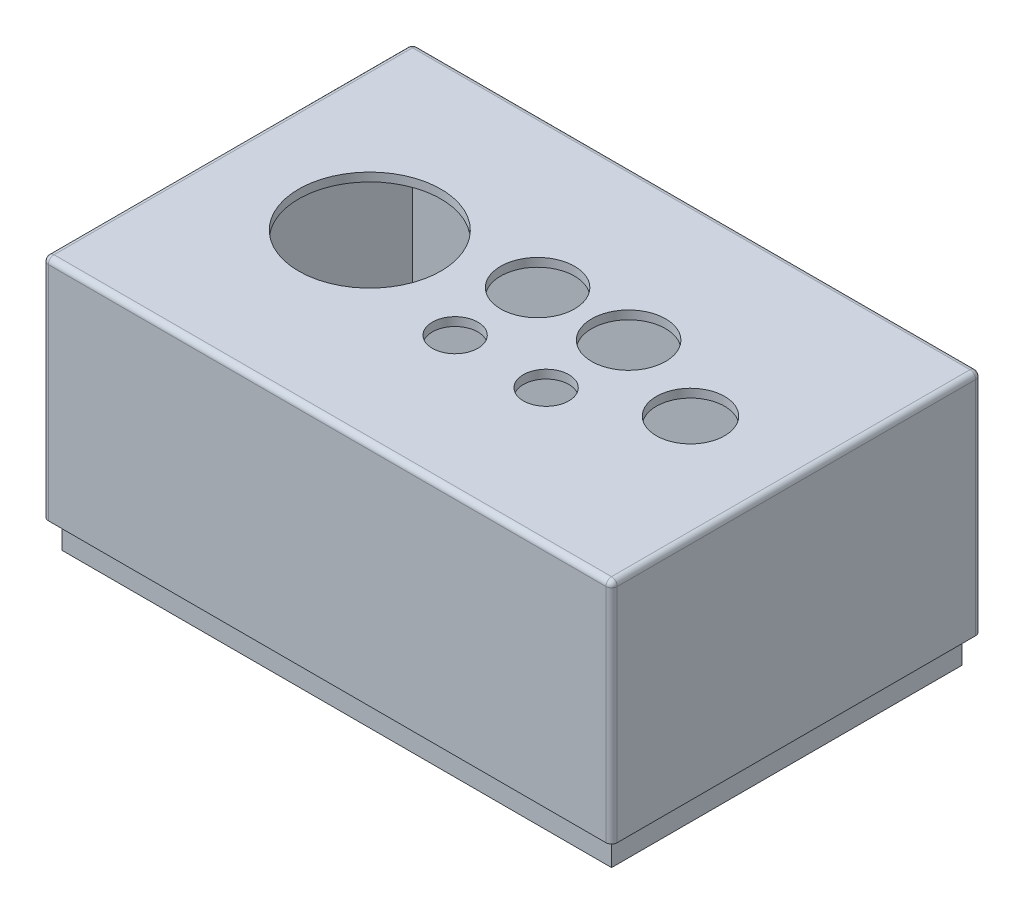
ISO-10303-21;
HEADER;
FILE_DESCRIPTION(('STEP AP214'),'2;1');
FILE_NAME('part.step','',(''),(''),'','','');
FILE_SCHEMA(('AUTOMOTIVE_DESIGN { 1 0 10303 214 1 1 1 1 }'));
ENDSEC;
DATA;
#1=APPLICATION_CONTEXT('core data for automotive mechanical design processes');
#2=APPLICATION_PROTOCOL_DEFINITION('international standard','automotive_design',2000,#1);
#3=PRODUCT_CONTEXT('',#1,'mechanical');
#4=PRODUCT('Part','Part','',(#3));
#5=PRODUCT_RELATED_PRODUCT_CATEGORY('part','',(#4));
#6=PRODUCT_DEFINITION_FORMATION('','',#4);
#7=PRODUCT_DEFINITION_CONTEXT('part definition',#1,'design');
#8=PRODUCT_DEFINITION('design','',#6,#7);
#9=PRODUCT_DEFINITION_SHAPE('','',#8);
#10=(LENGTH_UNIT() NAMED_UNIT(*) SI_UNIT(.MILLI.,.METRE.));
#11=(NAMED_UNIT(*) PLANE_ANGLE_UNIT() SI_UNIT($,.RADIAN.));
#12=(NAMED_UNIT(*) SI_UNIT($,.STERADIAN.) SOLID_ANGLE_UNIT());
#13=UNCERTAINTY_MEASURE_WITH_UNIT(LENGTH_MEASURE(1.E-05),#10,'distance_accuracy_value','');
#14=(GEOMETRIC_REPRESENTATION_CONTEXT(3) GLOBAL_UNCERTAINTY_ASSIGNED_CONTEXT((#13)) GLOBAL_UNIT_ASSIGNED_CONTEXT((#10,
#11,#12)) REPRESENTATION_CONTEXT('',''));
#15=CARTESIAN_POINT('',(0.,0.,0.));
#16=DIRECTION('',(0.,0.,1.));
#17=DIRECTION('',(1.,0.,0.));
#18=AXIS2_PLACEMENT_3D('',#15,#16,#17);
#19=CARTESIAN_POINT('',(0.,40.,0.));
#20=DIRECTION('',(0.,1.,0.));
#21=DIRECTION('',(0.,0.,1.));
#22=AXIS2_PLACEMENT_3D('',#19,#20,#21);
#23=PLANE('',#22);
#24=DIRECTION('',(0.,0.,-1.));
#25=VECTOR('',#24,1.);
#26=CARTESIAN_POINT('',(51.2395437262357,40.,-42.8555133079848));
#27=LINE('',#26,#25);
#28=CARTESIAN_POINT('',(51.2395437262358,40.,21.1444866920152));
#29=VERTEX_POINT('',#28);
#30=CARTESIAN_POINT('',(51.2395437262357,40.,-41.8555133079848));
#31=VERTEX_POINT('',#30);
#32=EDGE_CURVE('E236',#29,#31,#27,.T.);
#33=ORIENTED_EDGE('',*,*,#32,.F.);
#34=CARTESIAN_POINT('',(50.2395437262358,40.,21.1444866920152));
#35=DIRECTION('',(0.,1.,0.));
#36=DIRECTION('',(0.,0.,1.));
#37=AXIS2_PLACEMENT_3D('',#34,#35,#36);
#38=CIRCLE('',#37,1.);
#39=CARTESIAN_POINT('',(50.2395437262358,40.,22.1444866920152));
#40=VERTEX_POINT('',#39);
#41=EDGE_CURVE('E11',#29,#40,#38,.F.);
#42=ORIENTED_EDGE('',*,*,#41,.T.);
#43=DIRECTION('',(1.,0.,0.));
#44=VECTOR('',#43,1.);
#45=CARTESIAN_POINT('',(-48.7604562737643,40.,22.1444866920152));
#46=LINE('',#45,#44);
#47=CARTESIAN_POINT('',(-47.7604562737643,40.,22.1444866920152));
#48=VERTEX_POINT('',#47);
#49=EDGE_CURVE('E239',#48,#40,#46,.T.);
#50=ORIENTED_EDGE('',*,*,#49,.F.);
#51=CARTESIAN_POINT('',(-47.7604562737643,40.,21.1444866920152));
#52=DIRECTION('',(0.,1.,0.));
#53=DIRECTION('',(0.,0.,1.));
#54=AXIS2_PLACEMENT_3D('',#51,#52,#53);
#55=CIRCLE('',#54,1.);
#56=CARTESIAN_POINT('',(-48.7604562737643,40.,21.1444866920152));
#57=VERTEX_POINT('',#56);
#58=EDGE_CURVE('E41',#48,#57,#55,.F.);
#59=ORIENTED_EDGE('',*,*,#58,.T.);
#60=DIRECTION('',(0.,0.,1.));
#61=VECTOR('',#60,1.);
#62=CARTESIAN_POINT('',(-48.7604562737643,40.,-42.8555133079848));
#63=LINE('',#62,#61);
#64=CARTESIAN_POINT('',(-48.7604562737643,40.,-41.8555133079848));
#65=VERTEX_POINT('',#64);
#66=EDGE_CURVE('E241',#65,#57,#63,.T.);
#67=ORIENTED_EDGE('',*,*,#66,.F.);
#68=CARTESIAN_POINT('',(-47.7604562737643,40.,-41.8555133079848));
#69=DIRECTION('',(0.,1.,0.));
#70=DIRECTION('',(0.,0.,1.));
#71=AXIS2_PLACEMENT_3D('',#68,#69,#70);
#72=CIRCLE('',#71,1.);
#73=CARTESIAN_POINT('',(-47.7604562737643,40.,-42.8555133079848));
#74=VERTEX_POINT('',#73);
#75=EDGE_CURVE('E296',#65,#74,#72,.F.);
#76=ORIENTED_EDGE('',*,*,#75,.T.);
#77=DIRECTION('',(-1.,0.,0.));
#78=VECTOR('',#77,1.);
#79=CARTESIAN_POINT('',(-48.7604562737643,40.,-42.8555133079848));
#80=LINE('',#79,#78);
#81=CARTESIAN_POINT('',(50.2395437262357,40.,-42.8555133079848));
#82=VERTEX_POINT('',#81);
#83=EDGE_CURVE('E228',#82,#74,#80,.T.);
#84=ORIENTED_EDGE('',*,*,#83,.F.);
#85=CARTESIAN_POINT('',(50.2395437262357,40.,-41.8555133079848));
#86=DIRECTION('',(0.,1.,0.));
#87=DIRECTION('',(0.,0.,1.));
#88=AXIS2_PLACEMENT_3D('',#85,#86,#87);
#89=CIRCLE('',#88,1.);
#90=EDGE_CURVE('E294',#82,#31,#89,.F.);
#91=ORIENTED_EDGE('',*,*,#90,.T.);
#92=EDGE_LOOP('',(#33,#42,#50,#59,#67,#76,#84,#91));
#93=FACE_BOUND('',#92,.T.);
#94=DIRECTION('',(0.,0.,-1.));
#95=VECTOR('',#94,1.);
#96=CARTESIAN_POINT('',(-47.0604562737643,40.,20.4444866920152));
#97=LINE('',#96,#95);
#98=CARTESIAN_POINT('',(-47.0604562737643,40.,20.4444866920152));
#99=VERTEX_POINT('',#98);
#100=CARTESIAN_POINT('',(-47.0604562737643,40.,-41.1555133079848));
#101=VERTEX_POINT('',#100);
#102=EDGE_CURVE('E190',#99,#101,#97,.T.);
#103=ORIENTED_EDGE('',*,*,#102,.F.);
#104=DIRECTION('',(-1.,0.,0.));
#105=VECTOR('',#104,1.);
#106=CARTESIAN_POINT('',(-47.0604562737643,40.,20.4444866920152));
#107=LINE('',#106,#105);
#108=CARTESIAN_POINT('',(49.5395437262358,40.,20.4444866920152));
#109=VERTEX_POINT('',#108);
#110=EDGE_CURVE('E195',#109,#99,#107,.T.);
#111=ORIENTED_EDGE('',*,*,#110,.F.);
#112=DIRECTION('',(0.,0.,1.));
#113=VECTOR('',#112,1.);
#114=CARTESIAN_POINT('',(49.5395437262358,40.,20.4444866920152));
#115=LINE('',#114,#113);
#116=CARTESIAN_POINT('',(49.5395437262358,40.,-41.1555133079848));
#117=VERTEX_POINT('',#116);
#118=EDGE_CURVE('E207',#117,#109,#115,.T.);
#119=ORIENTED_EDGE('',*,*,#118,.F.);
#120=DIRECTION('',(1.,0.,0.));
#121=VECTOR('',#120,1.);
#122=CARTESIAN_POINT('',(-47.0604562737643,40.,-41.1555133079848));
#123=LINE('',#122,#121);
#124=EDGE_CURVE('E204',#101,#117,#123,.T.);
#125=ORIENTED_EDGE('',*,*,#124,.F.);
#126=EDGE_LOOP('',(#103,#111,#119,#125));
#127=FACE_BOUND('',#126,.T.);
#128=ADVANCED_FACE('F32',(#93,#127),#23,.F.);
#129=CARTESIAN_POINT('',(-48.7604562737643,80.,22.1444866920152));
#130=DIRECTION('',(0.,0.,-1.));
#131=DIRECTION('',(-1.,0.,0.));
#132=AXIS2_PLACEMENT_3D('',#129,#130,#131);
#133=PLANE('',#132);
#134=ORIENTED_EDGE('',*,*,#49,.T.);
#135=DIRECTION('',(0.,-1.,0.));
#136=VECTOR('',#135,1.);
#137=CARTESIAN_POINT('',(50.2395437262358,80.,22.1444866920152));
#138=LINE('',#137,#136);
#139=CARTESIAN_POINT('',(50.2395437262358,79.,22.1444866920152));
#140=VERTEX_POINT('',#139);
#141=EDGE_CURVE('E49',#40,#140,#138,.F.);
#142=ORIENTED_EDGE('',*,*,#141,.T.);
#143=DIRECTION('',(1.,0.,0.));
#144=VECTOR('',#143,1.);
#145=CARTESIAN_POINT('',(-48.7604562737643,79.,22.1444866920152));
#146=LINE('',#145,#144);
#147=CARTESIAN_POINT('',(-47.7604562737643,79.,22.1444866920152));
#148=VERTEX_POINT('',#147);
#149=EDGE_CURVE('E53',#140,#148,#146,.F.);
#150=ORIENTED_EDGE('',*,*,#149,.T.);
#151=DIRECTION('',(0.,-1.,0.));
#152=VECTOR('',#151,1.);
#153=CARTESIAN_POINT('',(-47.7604562737643,80.,22.1444866920152));
#154=LINE('',#153,#152);
#155=EDGE_CURVE('E290',#148,#48,#154,.T.);
#156=ORIENTED_EDGE('',*,*,#155,.T.);
#157=EDGE_LOOP('',(#134,#142,#150,#156));
#158=FACE_BOUND('',#157,.T.);
#159=ADVANCED_FACE('F360',(#158),#133,.F.);
#160=CARTESIAN_POINT('',(0.,80.,0.));
#161=DIRECTION('',(0.,1.,0.));
#162=DIRECTION('',(0.,0.,1.));
#163=AXIS2_PLACEMENT_3D('',#160,#161,#162);
#164=PLANE('',#163);
#165=DIRECTION('',(1.,0.,0.));
#166=VECTOR('',#165,1.);
#167=CARTESIAN_POINT('',(51.2395437262358,80.,21.1444866920152));
#168=LINE('',#167,#166);
#169=CARTESIAN_POINT('',(-47.7604562737643,80.,21.1444866920152));
#170=VERTEX_POINT('',#169);
#171=CARTESIAN_POINT('',(50.2395437262358,80.,21.1444866920152));
#172=VERTEX_POINT('',#171);
#173=EDGE_CURVE('E244',#170,#172,#168,.T.);
#174=ORIENTED_EDGE('',*,*,#173,.T.);
#175=DIRECTION('',(0.,0.,-1.));
#176=VECTOR('',#175,1.);
#177=CARTESIAN_POINT('',(50.2395437262357,80.,-42.8555133079848));
#178=LINE('',#177,#176);
#179=CARTESIAN_POINT('',(50.2395437262357,80.,-41.8555133079848));
#180=VERTEX_POINT('',#179);
#181=EDGE_CURVE('E268',#172,#180,#178,.T.);
#182=ORIENTED_EDGE('',*,*,#181,.T.);
#183=DIRECTION('',(-1.,0.,0.));
#184=VECTOR('',#183,1.);
#185=CARTESIAN_POINT('',(-48.7604562737643,80.,-41.8555133079848));
#186=LINE('',#185,#184);
#187=CARTESIAN_POINT('',(-47.7604562737643,80.,-41.8555133079848));
#188=VERTEX_POINT('',#187);
#189=EDGE_CURVE('E266',#180,#188,#186,.T.);
#190=ORIENTED_EDGE('',*,*,#189,.T.);
#191=DIRECTION('',(0.,0.,1.));
#192=VECTOR('',#191,1.);
#193=CARTESIAN_POINT('',(-47.7604562737643,80.,22.1444866920152));
#194=LINE('',#193,#192);
#195=EDGE_CURVE('E264',#188,#170,#194,.T.);
#196=ORIENTED_EDGE('',*,*,#195,.T.);
#197=EDGE_LOOP('',(#174,#182,#190,#196));
#198=FACE_BOUND('',#197,.T.);
#199=CARTESIAN_POINT('',(-23.7604562737643,80.,-10.3555133079848));
#200=DIRECTION('',(0.,1.,0.));
#201=DIRECTION('',(0.,0.,1.));
#202=AXIS2_PLACEMENT_3D('',#199,#200,#201);
#203=CIRCLE('',#202,12.5);
#204=CARTESIAN_POINT('',(-23.7604562737643,80.,2.14448669201523));
#205=VERTEX_POINT('',#204);
#206=EDGE_CURVE('E249',#205,#205,#203,.T.);
#207=ORIENTED_EDGE('',*,*,#206,.F.);
#208=EDGE_LOOP('',(#207));
#209=FACE_BOUND('',#208,.T.);
#210=CARTESIAN_POINT('',(15.7395437262358,80.,-16.3555133079848));
#211=DIRECTION('',(0.,1.,0.));
#212=DIRECTION('',(0.,0.,1.));
#213=AXIS2_PLACEMENT_3D('',#210,#211,#212);
#214=CIRCLE('',#213,6.5);
#215=CARTESIAN_POINT('',(15.7395437262358,80.,-9.85551330798477));
#216=VERTEX_POINT('',#215);
#217=EDGE_CURVE('E347',#216,#216,#214,.T.);
#218=ORIENTED_EDGE('',*,*,#217,.F.);
#219=EDGE_LOOP('',(#218));
#220=FACE_BOUND('',#219,.T.);
#221=CARTESIAN_POINT('',(-0.260456273764267,80.,-16.3555133079848));
#222=DIRECTION('',(0.,1.,0.));
#223=DIRECTION('',(0.,0.,1.));
#224=AXIS2_PLACEMENT_3D('',#221,#222,#223);
#225=CIRCLE('',#224,6.5);
#226=CARTESIAN_POINT('',(-0.260456273764267,80.,-9.85551330798477));
#227=VERTEX_POINT('',#226);
#228=EDGE_CURVE('E344',#227,#227,#225,.T.);
#229=ORIENTED_EDGE('',*,*,#228,.F.);
#230=EDGE_LOOP('',(#229));
#231=FACE_BOUND('',#230,.T.);
#232=CARTESIAN_POINT('',(15.7395437262358,80.,-1.85551330798477));
#233=DIRECTION('',(0.,1.,0.));
#234=DIRECTION('',(0.,0.,1.));
#235=AXIS2_PLACEMENT_3D('',#232,#233,#234);
#236=CIRCLE('',#235,4.);
#237=CARTESIAN_POINT('',(15.7395437262358,80.,2.14448669201523));
#238=VERTEX_POINT('',#237);
#239=EDGE_CURVE('E339',#238,#238,#236,.T.);
#240=ORIENTED_EDGE('',*,*,#239,.F.);
#241=EDGE_LOOP('',(#240));
#242=FACE_BOUND('',#241,.T.);
#243=CARTESIAN_POINT('',(-0.260456273764267,80.,-1.85551330798477));
#244=DIRECTION('',(0.,1.,0.));
#245=DIRECTION('',(0.,0.,1.));
#246=AXIS2_PLACEMENT_3D('',#243,#244,#245);
#247=CIRCLE('',#246,4.);
#248=CARTESIAN_POINT('',(-0.260456273764267,80.,2.14448669201523));
#249=VERTEX_POINT('',#248);
#250=EDGE_CURVE('E335',#249,#249,#247,.T.);
#251=ORIENTED_EDGE('',*,*,#250,.F.);
#252=EDGE_LOOP('',(#251));
#253=FACE_BOUND('',#252,.T.);
#254=CARTESIAN_POINT('',(32.7395437262358,80.,-10.2305133079848));
#255=DIRECTION('',(0.,1.,0.));
#256=DIRECTION('',(0.,0.,1.));
#257=AXIS2_PLACEMENT_3D('',#254,#255,#256);
#258=CIRCLE('',#257,6.);
#259=CARTESIAN_POINT('',(32.7395437262358,80.,-4.23051330798476));
#260=VERTEX_POINT('',#259);
#261=EDGE_CURVE('E332',#260,#260,#258,.T.);
#262=ORIENTED_EDGE('',*,*,#261,.F.);
#263=EDGE_LOOP('',(#262));
#264=FACE_BOUND('',#263,.T.);
#265=ADVANCED_FACE('F356',(#198,#209,#220,#231,#242,#253,#264),#164,.T.);
#266=CARTESIAN_POINT('',(-48.7604562737643,80.,-42.8555133079848));
#267=DIRECTION('',(1.,0.,0.));
#268=DIRECTION('',(0.,0.,-1.));
#269=AXIS2_PLACEMENT_3D('',#266,#267,#268);
#270=PLANE('',#269);
#271=ORIENTED_EDGE('',*,*,#66,.T.);
#272=DIRECTION('',(0.,-1.,0.));
#273=VECTOR('',#272,1.);
#274=CARTESIAN_POINT('',(-48.7604562737643,80.,21.1444866920152));
#275=LINE('',#274,#273);
#276=CARTESIAN_POINT('',(-48.7604562737643,79.,21.1444866920152));
#277=VERTEX_POINT('',#276);
#278=EDGE_CURVE('E288',#57,#277,#275,.F.);
#279=ORIENTED_EDGE('',*,*,#278,.T.);
#280=DIRECTION('',(0.,0.,1.));
#281=VECTOR('',#280,1.);
#282=CARTESIAN_POINT('',(-48.7604562737643,79.,-42.8555133079848));
#283=LINE('',#282,#281);
#284=CARTESIAN_POINT('',(-48.7604562737643,79.,-41.8555133079848));
#285=VERTEX_POINT('',#284);
#286=EDGE_CURVE('E286',#277,#285,#283,.F.);
#287=ORIENTED_EDGE('',*,*,#286,.T.);
#288=DIRECTION('',(0.,-1.,0.));
#289=VECTOR('',#288,1.);
#290=CARTESIAN_POINT('',(-48.7604562737643,80.,-41.8555133079848));
#291=LINE('',#290,#289);
#292=EDGE_CURVE('E284',#285,#65,#291,.T.);
#293=ORIENTED_EDGE('',*,*,#292,.T.);
#294=EDGE_LOOP('',(#271,#279,#287,#293));
#295=FACE_BOUND('',#294,.T.);
#296=ADVANCED_FACE('F359',(#295),#270,.F.);
#297=CARTESIAN_POINT('',(51.2395437262357,80.,-42.8555133079848));
#298=DIRECTION('',(-1.,0.,0.));
#299=DIRECTION('',(0.,0.,1.));
#300=AXIS2_PLACEMENT_3D('',#297,#298,#299);
#301=PLANE('',#300);
#302=DIRECTION('',(0.,0.,-1.));
#303=VECTOR('',#302,1.);
#304=CARTESIAN_POINT('',(51.2395437262358,79.,22.1444866920152));
#305=LINE('',#304,#303);
#306=CARTESIAN_POINT('',(51.2395437262357,79.,-41.8555133079848));
#307=VERTEX_POINT('',#306);
#308=CARTESIAN_POINT('',(51.2395437262358,79.,21.1444866920152));
#309=VERTEX_POINT('',#308);
#310=EDGE_CURVE('E273',#307,#309,#305,.F.);
#311=ORIENTED_EDGE('',*,*,#310,.T.);
#312=DIRECTION('',(0.,-1.,0.));
#313=VECTOR('',#312,1.);
#314=CARTESIAN_POINT('',(51.2395437262358,80.,21.1444866920152));
#315=LINE('',#314,#313);
#316=EDGE_CURVE('E276',#309,#29,#315,.T.);
#317=ORIENTED_EDGE('',*,*,#316,.T.);
#318=ORIENTED_EDGE('',*,*,#32,.T.);
#319=DIRECTION('',(0.,-1.,0.));
#320=VECTOR('',#319,1.);
#321=CARTESIAN_POINT('',(51.2395437262357,80.,-41.8555133079848));
#322=LINE('',#321,#320);
#323=EDGE_CURVE('E271',#31,#307,#322,.F.);
#324=ORIENTED_EDGE('',*,*,#323,.T.);
#325=EDGE_LOOP('',(#311,#317,#318,#324));
#326=FACE_BOUND('',#325,.T.);
#327=ADVANCED_FACE('F416',(#326),#301,.F.);
#328=CARTESIAN_POINT('',(-48.7604562737643,80.,-42.8555133079848));
#329=DIRECTION('',(0.,0.,1.));
#330=DIRECTION('',(1.,0.,0.));
#331=AXIS2_PLACEMENT_3D('',#328,#329,#330);
#332=PLANE('',#331);
#333=ORIENTED_EDGE('',*,*,#83,.T.);
#334=DIRECTION('',(0.,-1.,0.));
#335=VECTOR('',#334,1.);
#336=CARTESIAN_POINT('',(-47.7604562737643,80.,-42.8555133079848));
#337=LINE('',#336,#335);
#338=CARTESIAN_POINT('',(-47.7604562737643,79.,-42.8555133079848));
#339=VERTEX_POINT('',#338);
#340=EDGE_CURVE('E282',#74,#339,#337,.F.);
#341=ORIENTED_EDGE('',*,*,#340,.T.);
#342=DIRECTION('',(-1.,0.,0.));
#343=VECTOR('',#342,1.);
#344=CARTESIAN_POINT('',(51.2395437262357,79.,-42.8555133079848));
#345=LINE('',#344,#343);
#346=CARTESIAN_POINT('',(50.2395437262357,79.,-42.8555133079848));
#347=VERTEX_POINT('',#346);
#348=EDGE_CURVE('E280',#339,#347,#345,.F.);
#349=ORIENTED_EDGE('',*,*,#348,.T.);
#350=DIRECTION('',(0.,-1.,0.));
#351=VECTOR('',#350,1.);
#352=CARTESIAN_POINT('',(50.2395437262357,80.,-42.8555133079848));
#353=LINE('',#352,#351);
#354=EDGE_CURVE('E278',#347,#82,#353,.T.);
#355=ORIENTED_EDGE('',*,*,#354,.T.);
#356=EDGE_LOOP('',(#333,#341,#349,#355));
#357=FACE_BOUND('',#356,.T.);
#358=ADVANCED_FACE('F406',(#357),#332,.F.);
#359=CARTESIAN_POINT('',(0.,35.,0.));
#360=DIRECTION('',(0.,-1.,0.));
#361=DIRECTION('',(0.,0.,-1.));
#362=AXIS2_PLACEMENT_3D('',#359,#360,#361);
#363=PLANE('',#362);
#364=DIRECTION('',(0.,0.,-1.));
#365=VECTOR('',#364,1.);
#366=CARTESIAN_POINT('',(-47.0604562737643,35.,20.4444866920152));
#367=LINE('',#366,#365);
#368=CARTESIAN_POINT('',(-47.0604562737643,35.,20.4444866920152));
#369=VERTEX_POINT('',#368);
#370=CARTESIAN_POINT('',(-47.0604562737643,35.,-41.1555133079848));
#371=VERTEX_POINT('',#370);
#372=EDGE_CURVE('E191',#369,#371,#367,.T.);
#373=ORIENTED_EDGE('',*,*,#372,.T.);
#374=DIRECTION('',(1.,0.,0.));
#375=VECTOR('',#374,1.);
#376=CARTESIAN_POINT('',(-47.0604562737643,35.,-41.1555133079848));
#377=LINE('',#376,#375);
#378=CARTESIAN_POINT('',(49.5395437262358,35.,-41.1555133079848));
#379=VERTEX_POINT('',#378);
#380=EDGE_CURVE('E194',#371,#379,#377,.T.);
#381=ORIENTED_EDGE('',*,*,#380,.T.);
#382=DIRECTION('',(0.,0.,1.));
#383=VECTOR('',#382,1.);
#384=CARTESIAN_POINT('',(49.5395437262358,35.,20.4444866920152));
#385=LINE('',#384,#383);
#386=CARTESIAN_POINT('',(49.5395437262358,35.,20.4444866920152));
#387=VERTEX_POINT('',#386);
#388=EDGE_CURVE('E197',#379,#387,#385,.T.);
#389=ORIENTED_EDGE('',*,*,#388,.T.);
#390=DIRECTION('',(-1.,0.,0.));
#391=VECTOR('',#390,1.);
#392=CARTESIAN_POINT('',(-47.0604562737643,35.,20.4444866920152));
#393=LINE('',#392,#391);
#394=EDGE_CURVE('E199',#387,#369,#393,.T.);
#395=ORIENTED_EDGE('',*,*,#394,.T.);
#396=EDGE_LOOP('',(#373,#381,#389,#395));
#397=FACE_BOUND('',#396,.T.);
#398=DIRECTION('',(-1.,0.,0.));
#399=VECTOR('',#398,1.);
#400=CARTESIAN_POINT('',(47.5395437262358,35.,18.4444866920152));
#401=LINE('',#400,#399);
#402=CARTESIAN_POINT('',(47.5395437262358,35.,18.4444866920152));
#403=VERTEX_POINT('',#402);
#404=CARTESIAN_POINT('',(-45.0604562737642,35.,18.4444866920152));
#405=VERTEX_POINT('',#404);
#406=EDGE_CURVE('E163',#403,#405,#401,.T.);
#407=ORIENTED_EDGE('',*,*,#406,.F.);
#408=DIRECTION('',(0.,0.,1.));
#409=VECTOR('',#408,1.);
#410=CARTESIAN_POINT('',(47.5395437262358,35.,-39.1555133079848));
#411=LINE('',#410,#409);
#412=CARTESIAN_POINT('',(47.5395437262358,35.,-39.1555133079848));
#413=VERTEX_POINT('',#412);
#414=EDGE_CURVE('E172',#413,#403,#411,.T.);
#415=ORIENTED_EDGE('',*,*,#414,.F.);
#416=DIRECTION('',(1.,0.,0.));
#417=VECTOR('',#416,1.);
#418=CARTESIAN_POINT('',(47.5395437262358,35.,-39.1555133079848));
#419=LINE('',#418,#417);
#420=CARTESIAN_POINT('',(-45.0604562737642,35.,-39.1555133079848));
#421=VERTEX_POINT('',#420);
#422=EDGE_CURVE('E185',#421,#413,#419,.T.);
#423=ORIENTED_EDGE('',*,*,#422,.F.);
#424=DIRECTION('',(0.,0.,-1.));
#425=VECTOR('',#424,1.);
#426=CARTESIAN_POINT('',(-45.0604562737642,35.,-39.1555133079848));
#427=LINE('',#426,#425);
#428=EDGE_CURVE('E183',#405,#421,#427,.T.);
#429=ORIENTED_EDGE('',*,*,#428,.F.);
#430=EDGE_LOOP('',(#407,#415,#423,#429));
#431=FACE_BOUND('',#430,.T.);
#432=ADVANCED_FACE('F181',(#397,#431),#363,.T.);
#433=CARTESIAN_POINT('',(-47.0604562737643,35.,20.4444866920152));
#434=DIRECTION('',(1.,0.,0.));
#435=DIRECTION('',(0.,0.,-1.));
#436=AXIS2_PLACEMENT_3D('',#433,#434,#435);
#437=PLANE('',#436);
#438=ORIENTED_EDGE('',*,*,#102,.T.);
#439=DIRECTION('',(0.,1.,0.));
#440=VECTOR('',#439,1.);
#441=CARTESIAN_POINT('',(-47.0604562737643,35.,-41.1555133079848));
#442=LINE('',#441,#440);
#443=EDGE_CURVE('E169',#371,#101,#442,.T.);
#444=ORIENTED_EDGE('',*,*,#443,.F.);
#445=ORIENTED_EDGE('',*,*,#372,.F.);
#446=DIRECTION('',(0.,1.,0.));
#447=VECTOR('',#446,1.);
#448=CARTESIAN_POINT('',(-47.0604562737643,35.,20.4444866920152));
#449=LINE('',#448,#447);
#450=EDGE_CURVE('E201',#369,#99,#449,.T.);
#451=ORIENTED_EDGE('',*,*,#450,.T.);
#452=EDGE_LOOP('',(#438,#444,#445,#451));
#453=FACE_BOUND('',#452,.T.);
#454=ADVANCED_FACE('F423',(#453),#437,.F.);
#455=CARTESIAN_POINT('',(-47.0604562737643,35.,-41.1555133079848));
#456=DIRECTION('',(0.,0.,1.));
#457=DIRECTION('',(1.,0.,0.));
#458=AXIS2_PLACEMENT_3D('',#455,#456,#457);
#459=PLANE('',#458);
#460=ORIENTED_EDGE('',*,*,#124,.T.);
#461=DIRECTION('',(0.,1.,0.));
#462=VECTOR('',#461,1.);
#463=CARTESIAN_POINT('',(49.5395437262358,35.,-41.1555133079848));
#464=LINE('',#463,#462);
#465=EDGE_CURVE('E217',#379,#117,#464,.T.);
#466=ORIENTED_EDGE('',*,*,#465,.F.);
#467=ORIENTED_EDGE('',*,*,#380,.F.);
#468=ORIENTED_EDGE('',*,*,#443,.T.);
#469=EDGE_LOOP('',(#460,#466,#467,#468));
#470=FACE_BOUND('',#469,.T.);
#471=ADVANCED_FACE('F691',(#470),#459,.F.);
#472=CARTESIAN_POINT('',(49.5395437262358,35.,20.4444866920152));
#473=DIRECTION('',(-1.,0.,0.));
#474=DIRECTION('',(0.,0.,1.));
#475=AXIS2_PLACEMENT_3D('',#472,#473,#474);
#476=PLANE('',#475);
#477=ORIENTED_EDGE('',*,*,#118,.T.);
#478=DIRECTION('',(0.,1.,0.));
#479=VECTOR('',#478,1.);
#480=CARTESIAN_POINT('',(49.5395437262358,35.,20.4444866920152));
#481=LINE('',#480,#479);
#482=EDGE_CURVE('E214',#387,#109,#481,.T.);
#483=ORIENTED_EDGE('',*,*,#482,.F.);
#484=ORIENTED_EDGE('',*,*,#388,.F.);
#485=ORIENTED_EDGE('',*,*,#465,.T.);
#486=EDGE_LOOP('',(#477,#483,#484,#485));
#487=FACE_BOUND('',#486,.T.);
#488=ADVANCED_FACE('F687',(#487),#476,.F.);
#489=CARTESIAN_POINT('',(-47.0604562737643,35.,20.4444866920152));
#490=DIRECTION('',(0.,0.,-1.));
#491=DIRECTION('',(-1.,0.,0.));
#492=AXIS2_PLACEMENT_3D('',#489,#490,#491);
#493=PLANE('',#492);
#494=ORIENTED_EDGE('',*,*,#110,.T.);
#495=ORIENTED_EDGE('',*,*,#450,.F.);
#496=ORIENTED_EDGE('',*,*,#394,.F.);
#497=ORIENTED_EDGE('',*,*,#482,.T.);
#498=EDGE_LOOP('',(#494,#495,#496,#497));
#499=FACE_BOUND('',#498,.T.);
#500=ADVANCED_FACE('F383',(#499),#493,.F.);
#501=CARTESIAN_POINT('',(0.,78.5,0.));
#502=DIRECTION('',(0.,1.,0.));
#503=DIRECTION('',(0.,0.,1.));
#504=AXIS2_PLACEMENT_3D('',#501,#502,#503);
#505=PLANE('',#504);
#506=CARTESIAN_POINT('',(-23.7604562737643,78.5,-10.3555133079848));
#507=DIRECTION('',(0.,1.,0.));
#508=DIRECTION('',(0.,0.,1.));
#509=AXIS2_PLACEMENT_3D('',#506,#507,#508);
#510=CIRCLE('',#509,12.5);
#511=CARTESIAN_POINT('',(-23.7604562737643,78.5,2.14448669201523));
#512=VERTEX_POINT('',#511);
#513=EDGE_CURVE('E179',#512,#512,#510,.T.);
#514=ORIENTED_EDGE('',*,*,#513,.T.);
#515=EDGE_LOOP('',(#514));
#516=FACE_BOUND('',#515,.T.);
#517=CARTESIAN_POINT('',(15.7395437262358,78.5,-16.3555133079848));
#518=DIRECTION('',(0.,1.,0.));
#519=DIRECTION('',(0.,0.,1.));
#520=AXIS2_PLACEMENT_3D('',#517,#518,#519);
#521=CIRCLE('',#520,6.5);
#522=CARTESIAN_POINT('',(15.7395437262358,78.5,-9.85551330798477));
#523=VERTEX_POINT('',#522);
#524=EDGE_CURVE('E258',#523,#523,#521,.T.);
#525=ORIENTED_EDGE('',*,*,#524,.T.);
#526=EDGE_LOOP('',(#525));
#527=FACE_BOUND('',#526,.T.);
#528=CARTESIAN_POINT('',(-0.260456273764267,78.5,-16.3555133079848));
#529=DIRECTION('',(0.,1.,0.));
#530=DIRECTION('',(0.,0.,1.));
#531=AXIS2_PLACEMENT_3D('',#528,#529,#530);
#532=CIRCLE('',#531,6.5);
#533=CARTESIAN_POINT('',(-0.260456273764267,78.5,-9.85551330798477));
#534=VERTEX_POINT('',#533);
#535=EDGE_CURVE('E255',#534,#534,#532,.T.);
#536=ORIENTED_EDGE('',*,*,#535,.T.);
#537=EDGE_LOOP('',(#536));
#538=FACE_BOUND('',#537,.T.);
#539=CARTESIAN_POINT('',(15.7395437262358,78.5,-1.85551330798477));
#540=DIRECTION('',(0.,1.,0.));
#541=DIRECTION('',(0.,0.,1.));
#542=AXIS2_PLACEMENT_3D('',#539,#540,#541);
#543=CIRCLE('',#542,4.);
#544=CARTESIAN_POINT('',(15.7395437262358,78.5,2.14448669201523));
#545=VERTEX_POINT('',#544);
#546=EDGE_CURVE('E252',#545,#545,#543,.T.);
#547=ORIENTED_EDGE('',*,*,#546,.T.);
#548=EDGE_LOOP('',(#547));
#549=FACE_BOUND('',#548,.T.);
#550=CARTESIAN_POINT('',(-0.260456273764267,78.5,-1.85551330798477));
#551=DIRECTION('',(0.,1.,0.));
#552=DIRECTION('',(0.,0.,1.));
#553=AXIS2_PLACEMENT_3D('',#550,#551,#552);
#554=CIRCLE('',#553,4.);
#555=CARTESIAN_POINT('',(-0.260456273764267,78.5,2.14448669201523));
#556=VERTEX_POINT('',#555);
#557=EDGE_CURVE('E248',#556,#556,#554,.T.);
#558=ORIENTED_EDGE('',*,*,#557,.T.);
#559=EDGE_LOOP('',(#558));
#560=FACE_BOUND('',#559,.T.);
#561=CARTESIAN_POINT('',(32.7395437262358,78.5,-10.2305133079848));
#562=DIRECTION('',(0.,1.,0.));
#563=DIRECTION('',(0.,0.,1.));
#564=AXIS2_PLACEMENT_3D('',#561,#562,#563);
#565=CIRCLE('',#564,6.);
#566=CARTESIAN_POINT('',(32.7395437262358,78.5,-4.23051330798476));
#567=VERTEX_POINT('',#566);
#568=EDGE_CURVE('E245',#567,#567,#565,.T.);
#569=ORIENTED_EDGE('',*,*,#568,.T.);
#570=EDGE_LOOP('',(#569));
#571=FACE_BOUND('',#570,.T.);
#572=DIRECTION('',(-1.,0.,0.));
#573=VECTOR('',#572,1.);
#574=CARTESIAN_POINT('',(47.5395437262358,78.5,18.4444866920152));
#575=LINE('',#574,#573);
#576=CARTESIAN_POINT('',(47.5395437262358,78.5,18.4444866920152));
#577=VERTEX_POINT('',#576);
#578=CARTESIAN_POINT('',(-45.0604562737642,78.5,18.4444866920152));
#579=VERTEX_POINT('',#578);
#580=EDGE_CURVE('E165',#577,#579,#575,.T.);
#581=ORIENTED_EDGE('',*,*,#580,.T.);
#582=DIRECTION('',(0.,0.,-1.));
#583=VECTOR('',#582,1.);
#584=CARTESIAN_POINT('',(-45.0604562737642,78.5,-39.1555133079848));
#585=LINE('',#584,#583);
#586=CARTESIAN_POINT('',(-45.0604562737642,78.5,-39.1555133079848));
#587=VERTEX_POINT('',#586);
#588=EDGE_CURVE('E229',#579,#587,#585,.T.);
#589=ORIENTED_EDGE('',*,*,#588,.T.);
#590=DIRECTION('',(1.,0.,0.));
#591=VECTOR('',#590,1.);
#592=CARTESIAN_POINT('',(47.5395437262358,78.5,-39.1555133079848));
#593=LINE('',#592,#591);
#594=CARTESIAN_POINT('',(47.5395437262358,78.5,-39.1555133079848));
#595=VERTEX_POINT('',#594);
#596=EDGE_CURVE('E231',#587,#595,#593,.T.);
#597=ORIENTED_EDGE('',*,*,#596,.T.);
#598=DIRECTION('',(0.,0.,1.));
#599=VECTOR('',#598,1.);
#600=CARTESIAN_POINT('',(47.5395437262358,78.5,-39.1555133079848));
#601=LINE('',#600,#599);
#602=EDGE_CURVE('E225',#595,#577,#601,.T.);
#603=ORIENTED_EDGE('',*,*,#602,.T.);
#604=EDGE_LOOP('',(#581,#589,#597,#603));
#605=FACE_BOUND('',#604,.T.);
#606=ADVANCED_FACE('F380',(#516,#527,#538,#549,#560,#571,#605),#505,.F.);
#607=CARTESIAN_POINT('',(47.5395437262358,80.002,-39.1555133079848));
#608=DIRECTION('',(1.,0.,0.));
#609=DIRECTION('',(0.,0.,-1.));
#610=AXIS2_PLACEMENT_3D('',#607,#608,#609);
#611=PLANE('',#610);
#612=ORIENTED_EDGE('',*,*,#602,.F.);
#613=DIRECTION('',(0.,-1.,0.));
#614=VECTOR('',#613,1.);
#615=CARTESIAN_POINT('',(47.5395437262358,80.002,-39.1555133079848));
#616=LINE('',#615,#614);
#617=EDGE_CURVE('E175',#595,#413,#616,.T.);
#618=ORIENTED_EDGE('',*,*,#617,.T.);
#619=ORIENTED_EDGE('',*,*,#414,.T.);
#620=DIRECTION('',(0.,-1.,0.));
#621=VECTOR('',#620,1.);
#622=CARTESIAN_POINT('',(47.5395437262358,80.002,18.4444866920152));
#623=LINE('',#622,#621);
#624=EDGE_CURVE('E158',#577,#403,#623,.T.);
#625=ORIENTED_EDGE('',*,*,#624,.F.);
#626=EDGE_LOOP('',(#612,#618,#619,#625));
#627=FACE_BOUND('',#626,.T.);
#628=ADVANCED_FACE('F173',(#627),#611,.F.);
#629=CARTESIAN_POINT('',(47.5395437262358,80.002,-39.1555133079848));
#630=DIRECTION('',(0.,0.,-1.));
#631=DIRECTION('',(-1.,0.,0.));
#632=AXIS2_PLACEMENT_3D('',#629,#630,#631);
#633=PLANE('',#632);
#634=ORIENTED_EDGE('',*,*,#596,.F.);
#635=DIRECTION('',(0.,-1.,0.));
#636=VECTOR('',#635,1.);
#637=CARTESIAN_POINT('',(-45.0604562737642,80.002,-39.1555133079848));
#638=LINE('',#637,#636);
#639=EDGE_CURVE('E223',#587,#421,#638,.T.);
#640=ORIENTED_EDGE('',*,*,#639,.T.);
#641=ORIENTED_EDGE('',*,*,#422,.T.);
#642=ORIENTED_EDGE('',*,*,#617,.F.);
#643=EDGE_LOOP('',(#634,#640,#641,#642));
#644=FACE_BOUND('',#643,.T.);
#645=ADVANCED_FACE('F394',(#644),#633,.F.);
#646=CARTESIAN_POINT('',(-45.0604562737642,80.002,-39.1555133079848));
#647=DIRECTION('',(-1.,0.,0.));
#648=DIRECTION('',(0.,0.,1.));
#649=AXIS2_PLACEMENT_3D('',#646,#647,#648);
#650=PLANE('',#649);
#651=ORIENTED_EDGE('',*,*,#588,.F.);
#652=DIRECTION('',(0.,-1.,0.));
#653=VECTOR('',#652,1.);
#654=CARTESIAN_POINT('',(-45.0604562737642,80.002,18.4444866920152));
#655=LINE('',#654,#653);
#656=EDGE_CURVE('E168',#579,#405,#655,.T.);
#657=ORIENTED_EDGE('',*,*,#656,.T.);
#658=ORIENTED_EDGE('',*,*,#428,.T.);
#659=ORIENTED_EDGE('',*,*,#639,.F.);
#660=EDGE_LOOP('',(#651,#657,#658,#659));
#661=FACE_BOUND('',#660,.T.);
#662=ADVANCED_FACE('F392',(#661),#650,.F.);
#663=CARTESIAN_POINT('',(47.5395437262358,80.002,18.4444866920152));
#664=DIRECTION('',(0.,0.,1.));
#665=DIRECTION('',(1.,0.,0.));
#666=AXIS2_PLACEMENT_3D('',#663,#664,#665);
#667=PLANE('',#666);
#668=ORIENTED_EDGE('',*,*,#580,.F.);
#669=ORIENTED_EDGE('',*,*,#624,.T.);
#670=ORIENTED_EDGE('',*,*,#406,.T.);
#671=ORIENTED_EDGE('',*,*,#656,.F.);
#672=EDGE_LOOP('',(#668,#669,#670,#671));
#673=FACE_BOUND('',#672,.T.);
#674=ADVANCED_FACE('F160',(#673),#667,.F.);
#675=CARTESIAN_POINT('',(32.7395437262358,75.,-10.2305133079848));
#676=DIRECTION('',(0.,1.,0.));
#677=DIRECTION('',(0.,0.,1.));
#678=AXIS2_PLACEMENT_3D('',#675,#676,#677);
#679=CYLINDRICAL_SURFACE('',#678,6.);
#680=ORIENTED_EDGE('',*,*,#261,.T.);
#681=EDGE_LOOP('',(#680));
#682=FACE_BOUND('',#681,.T.);
#683=ORIENTED_EDGE('',*,*,#568,.F.);
#684=EDGE_LOOP('',(#683));
#685=FACE_BOUND('',#684,.T.);
#686=ADVANCED_FACE('F376',(#682,#685),#679,.F.);
#687=CARTESIAN_POINT('',(-0.260456273764267,75.,-1.85551330798477));
#688=DIRECTION('',(0.,1.,0.));
#689=DIRECTION('',(0.,0.,1.));
#690=AXIS2_PLACEMENT_3D('',#687,#688,#689);
#691=CYLINDRICAL_SURFACE('',#690,4.);
#692=ORIENTED_EDGE('',*,*,#250,.T.);
#693=EDGE_LOOP('',(#692));
#694=FACE_BOUND('',#693,.T.);
#695=ORIENTED_EDGE('',*,*,#557,.F.);
#696=EDGE_LOOP('',(#695));
#697=FACE_BOUND('',#696,.T.);
#698=ADVANCED_FACE('F372',(#694,#697),#691,.F.);
#699=CARTESIAN_POINT('',(15.7395437262358,75.,-1.85551330798477));
#700=DIRECTION('',(0.,1.,0.));
#701=DIRECTION('',(0.,0.,1.));
#702=AXIS2_PLACEMENT_3D('',#699,#700,#701);
#703=CYLINDRICAL_SURFACE('',#702,4.);
#704=ORIENTED_EDGE('',*,*,#239,.T.);
#705=EDGE_LOOP('',(#704));
#706=FACE_BOUND('',#705,.T.);
#707=ORIENTED_EDGE('',*,*,#546,.F.);
#708=EDGE_LOOP('',(#707));
#709=FACE_BOUND('',#708,.T.);
#710=ADVANCED_FACE('F375',(#706,#709),#703,.F.);
#711=CARTESIAN_POINT('',(-0.260456273764267,75.,-16.3555133079848));
#712=DIRECTION('',(0.,1.,0.));
#713=DIRECTION('',(0.,0.,1.));
#714=AXIS2_PLACEMENT_3D('',#711,#712,#713);
#715=CYLINDRICAL_SURFACE('',#714,6.5);
#716=ORIENTED_EDGE('',*,*,#228,.T.);
#717=EDGE_LOOP('',(#716));
#718=FACE_BOUND('',#717,.T.);
#719=ORIENTED_EDGE('',*,*,#535,.F.);
#720=EDGE_LOOP('',(#719));
#721=FACE_BOUND('',#720,.T.);
#722=ADVANCED_FACE('F647',(#718,#721),#715,.F.);
#723=CARTESIAN_POINT('',(15.7395437262358,75.,-16.3555133079848));
#724=DIRECTION('',(0.,1.,0.));
#725=DIRECTION('',(0.,0.,1.));
#726=AXIS2_PLACEMENT_3D('',#723,#724,#725);
#727=CYLINDRICAL_SURFACE('',#726,6.5);
#728=ORIENTED_EDGE('',*,*,#217,.T.);
#729=EDGE_LOOP('',(#728));
#730=FACE_BOUND('',#729,.T.);
#731=ORIENTED_EDGE('',*,*,#524,.F.);
#732=EDGE_LOOP('',(#731));
#733=FACE_BOUND('',#732,.T.);
#734=ADVANCED_FACE('F657',(#730,#733),#727,.F.);
#735=CARTESIAN_POINT('',(-23.7604562737643,75.,-10.3555133079848));
#736=DIRECTION('',(0.,1.,0.));
#737=DIRECTION('',(0.,0.,1.));
#738=AXIS2_PLACEMENT_3D('',#735,#736,#737);
#739=CYLINDRICAL_SURFACE('',#738,12.5);
#740=ORIENTED_EDGE('',*,*,#206,.T.);
#741=EDGE_LOOP('',(#740));
#742=FACE_BOUND('',#741,.T.);
#743=ORIENTED_EDGE('',*,*,#513,.F.);
#744=EDGE_LOOP('',(#743));
#745=FACE_BOUND('',#744,.T.);
#746=ADVANCED_FACE('F353',(#742,#745),#739,.F.);
#747=CARTESIAN_POINT('',(-47.7604562737643,80.,21.1444866920152));
#748=DIRECTION('',(0.,-1.,0.));
#749=DIRECTION('',(0.,0.,-1.));
#750=AXIS2_PLACEMENT_3D('',#747,#748,#749);
#751=CYLINDRICAL_SURFACE('',#750,1.);
#752=ORIENTED_EDGE('',*,*,#58,.F.);
#753=ORIENTED_EDGE('',*,*,#155,.F.);
#754=CARTESIAN_POINT('',(-47.7604562737643,79.,21.1444866920152));
#755=DIRECTION('',(0.,1.,0.));
#756=DIRECTION('',(0.,0.,1.));
#757=AXIS2_PLACEMENT_3D('',#754,#755,#756);
#758=CIRCLE('',#757,1.);
#759=EDGE_CURVE('E36',#277,#148,#758,.T.);
#760=ORIENTED_EDGE('',*,*,#759,.F.);
#761=ORIENTED_EDGE('',*,*,#278,.F.);
#762=EDGE_LOOP('',(#752,#753,#760,#761));
#763=FACE_BOUND('',#762,.T.);
#764=ADVANCED_FACE('F34',(#763),#751,.T.);
#765=CARTESIAN_POINT('',(-47.7604562737643,79.,0.));
#766=DIRECTION('',(0.,0.,-1.));
#767=DIRECTION('',(-1.,0.,0.));
#768=AXIS2_PLACEMENT_3D('',#765,#766,#767);
#769=CYLINDRICAL_SURFACE('',#768,1.);
#770=CARTESIAN_POINT('',(-47.7604562737643,79.,-41.8555133079848));
#771=DIRECTION('',(0.,0.,-1.));
#772=DIRECTION('',(-1.,0.,0.));
#773=AXIS2_PLACEMENT_3D('',#770,#771,#772);
#774=CIRCLE('',#773,1.);
#775=EDGE_CURVE('E324',#285,#188,#774,.T.);
#776=ORIENTED_EDGE('',*,*,#775,.F.);
#777=ORIENTED_EDGE('',*,*,#286,.F.);
#778=CARTESIAN_POINT('',(-47.7604562737643,79.,21.1444866920152));
#779=DIRECTION('',(0.,0.,1.));
#780=DIRECTION('',(1.,0.,0.));
#781=AXIS2_PLACEMENT_3D('',#778,#779,#780);
#782=CIRCLE('',#781,1.);
#783=EDGE_CURVE('E326',#170,#277,#782,.T.);
#784=ORIENTED_EDGE('',*,*,#783,.F.);
#785=ORIENTED_EDGE('',*,*,#195,.F.);
#786=EDGE_LOOP('',(#776,#777,#784,#785));
#787=FACE_BOUND('',#786,.T.);
#788=ADVANCED_FACE('F464',(#787),#769,.T.);
#789=CARTESIAN_POINT('',(-47.7604562737643,80.,-41.8555133079848));
#790=DIRECTION('',(0.,-1.,0.));
#791=DIRECTION('',(0.,0.,-1.));
#792=AXIS2_PLACEMENT_3D('',#789,#790,#791);
#793=CYLINDRICAL_SURFACE('',#792,1.);
#794=ORIENTED_EDGE('',*,*,#75,.F.);
#795=ORIENTED_EDGE('',*,*,#292,.F.);
#796=CARTESIAN_POINT('',(-47.7604562737643,79.,-41.8555133079848));
#797=DIRECTION('',(0.,1.,0.));
#798=DIRECTION('',(0.,0.,1.));
#799=AXIS2_PLACEMENT_3D('',#796,#797,#798);
#800=CIRCLE('',#799,1.);
#801=EDGE_CURVE('E321',#339,#285,#800,.T.);
#802=ORIENTED_EDGE('',*,*,#801,.F.);
#803=ORIENTED_EDGE('',*,*,#340,.F.);
#804=EDGE_LOOP('',(#794,#795,#802,#803));
#805=FACE_BOUND('',#804,.T.);
#806=ADVANCED_FACE('F456',(#805),#793,.T.);
#807=CARTESIAN_POINT('',(-47.7604562737643,79.,21.1444866920152));
#808=DIRECTION('',(-1.,0.,0.));
#809=DIRECTION('',(0.,0.,1.));
#810=AXIS2_PLACEMENT_3D('',#807,#808,#809);
#811=SPHERICAL_SURFACE('',#810,1.);
#812=ORIENTED_EDGE('',*,*,#783,.T.);
#813=ORIENTED_EDGE('',*,*,#759,.T.);
#814=CARTESIAN_POINT('',(-47.7604562737643,79.,21.1444866920152));
#815=DIRECTION('',(-1.,0.,0.));
#816=DIRECTION('',(0.,0.,1.));
#817=AXIS2_PLACEMENT_3D('',#814,#815,#816);
#818=CIRCLE('',#817,1.);
#819=EDGE_CURVE('E318',#170,#148,#818,.F.);
#820=ORIENTED_EDGE('',*,*,#819,.F.);
#821=EDGE_LOOP('',(#812,#813,#820));
#822=FACE_BOUND('',#821,.T.);
#823=ADVANCED_FACE('F453',(#822),#811,.T.);
#824=CARTESIAN_POINT('',(-47.7604562737643,79.,-41.8555133079848));
#825=DIRECTION('',(-1.,0.,0.));
#826=DIRECTION('',(0.,0.,1.));
#827=AXIS2_PLACEMENT_3D('',#824,#825,#826);
#828=SPHERICAL_SURFACE('',#827,1.);
#829=ORIENTED_EDGE('',*,*,#801,.T.);
#830=ORIENTED_EDGE('',*,*,#775,.T.);
#831=CARTESIAN_POINT('',(-47.7604562737643,79.,-41.8555133079848));
#832=DIRECTION('',(-1.,0.,0.));
#833=DIRECTION('',(0.,0.,1.));
#834=AXIS2_PLACEMENT_3D('',#831,#832,#833);
#835=CIRCLE('',#834,1.);
#836=EDGE_CURVE('E315',#339,#188,#835,.F.);
#837=ORIENTED_EDGE('',*,*,#836,.F.);
#838=EDGE_LOOP('',(#829,#830,#837));
#839=FACE_BOUND('',#838,.T.);
#840=ADVANCED_FACE('F455',(#839),#828,.T.);
#841=CARTESIAN_POINT('',(50.2395437262358,80.,21.1444866920152));
#842=DIRECTION('',(0.,-1.,0.));
#843=DIRECTION('',(0.,0.,-1.));
#844=AXIS2_PLACEMENT_3D('',#841,#842,#843);
#845=CYLINDRICAL_SURFACE('',#844,1.);
#846=ORIENTED_EDGE('',*,*,#41,.F.);
#847=ORIENTED_EDGE('',*,*,#316,.F.);
#848=CARTESIAN_POINT('',(50.2395437262358,79.,21.1444866920152));
#849=DIRECTION('',(0.,1.,0.));
#850=DIRECTION('',(0.,0.,1.));
#851=AXIS2_PLACEMENT_3D('',#848,#849,#850);
#852=CIRCLE('',#851,1.);
#853=EDGE_CURVE('E312',#140,#309,#852,.T.);
#854=ORIENTED_EDGE('',*,*,#853,.F.);
#855=ORIENTED_EDGE('',*,*,#141,.F.);
#856=EDGE_LOOP('',(#846,#847,#854,#855));
#857=FACE_BOUND('',#856,.T.);
#858=ADVANCED_FACE('F443',(#857),#845,.T.);
#859=CARTESIAN_POINT('',(0.,79.,21.1444866920152));
#860=DIRECTION('',(-1.,0.,0.));
#861=DIRECTION('',(0.,0.,1.));
#862=AXIS2_PLACEMENT_3D('',#859,#860,#861);
#863=CYLINDRICAL_SURFACE('',#862,1.);
#864=ORIENTED_EDGE('',*,*,#819,.T.);
#865=ORIENTED_EDGE('',*,*,#149,.F.);
#866=CARTESIAN_POINT('',(50.2395437262358,79.,21.1444866920152));
#867=DIRECTION('',(1.,0.,0.));
#868=DIRECTION('',(0.,0.,-1.));
#869=AXIS2_PLACEMENT_3D('',#866,#867,#868);
#870=CIRCLE('',#869,1.);
#871=EDGE_CURVE('E309',#172,#140,#870,.T.);
#872=ORIENTED_EDGE('',*,*,#871,.F.);
#873=ORIENTED_EDGE('',*,*,#173,.F.);
#874=EDGE_LOOP('',(#864,#865,#872,#873));
#875=FACE_BOUND('',#874,.T.);
#876=ADVANCED_FACE('F452',(#875),#863,.T.);
#877=CARTESIAN_POINT('',(0.,79.,-41.8555133079848));
#878=DIRECTION('',(1.,0.,0.));
#879=DIRECTION('',(0.,0.,-1.));
#880=AXIS2_PLACEMENT_3D('',#877,#878,#879);
#881=CYLINDRICAL_SURFACE('',#880,1.);
#882=ORIENTED_EDGE('',*,*,#836,.T.);
#883=ORIENTED_EDGE('',*,*,#189,.F.);
#884=CARTESIAN_POINT('',(50.2395437262357,79.,-41.8555133079848));
#885=DIRECTION('',(1.,0.,0.));
#886=DIRECTION('',(0.,0.,-1.));
#887=AXIS2_PLACEMENT_3D('',#884,#885,#886);
#888=CIRCLE('',#887,1.);
#889=EDGE_CURVE('E306',#347,#180,#888,.T.);
#890=ORIENTED_EDGE('',*,*,#889,.F.);
#891=ORIENTED_EDGE('',*,*,#348,.F.);
#892=EDGE_LOOP('',(#882,#883,#890,#891));
#893=FACE_BOUND('',#892,.T.);
#894=ADVANCED_FACE('F490',(#893),#881,.T.);
#895=CARTESIAN_POINT('',(50.2395437262357,80.,-41.8555133079848));
#896=DIRECTION('',(0.,-1.,0.));
#897=DIRECTION('',(0.,0.,-1.));
#898=AXIS2_PLACEMENT_3D('',#895,#896,#897);
#899=CYLINDRICAL_SURFACE('',#898,1.);
#900=ORIENTED_EDGE('',*,*,#90,.F.);
#901=ORIENTED_EDGE('',*,*,#354,.F.);
#902=CARTESIAN_POINT('',(50.2395437262357,79.,-41.8555133079848));
#903=DIRECTION('',(0.,1.,0.));
#904=DIRECTION('',(0.,0.,1.));
#905=AXIS2_PLACEMENT_3D('',#902,#903,#904);
#906=CIRCLE('',#905,1.);
#907=EDGE_CURVE('E303',#307,#347,#906,.T.);
#908=ORIENTED_EDGE('',*,*,#907,.F.);
#909=ORIENTED_EDGE('',*,*,#323,.F.);
#910=EDGE_LOOP('',(#900,#901,#908,#909));
#911=FACE_BOUND('',#910,.T.);
#912=ADVANCED_FACE('F485',(#911),#899,.T.);
#913=CARTESIAN_POINT('',(50.2395437262358,79.,21.1444866920152));
#914=DIRECTION('',(0.,0.,1.));
#915=DIRECTION('',(1.,0.,0.));
#916=AXIS2_PLACEMENT_3D('',#913,#914,#915);
#917=SPHERICAL_SURFACE('',#916,1.);
#918=ORIENTED_EDGE('',*,*,#871,.T.);
#919=ORIENTED_EDGE('',*,*,#853,.T.);
#920=CARTESIAN_POINT('',(50.2395437262358,79.,21.1444866920152));
#921=DIRECTION('',(0.,0.,1.));
#922=DIRECTION('',(0.,-1.,0.));
#923=AXIS2_PLACEMENT_3D('',#920,#921,#922);
#924=CIRCLE('',#923,1.);
#925=EDGE_CURVE('E301',#172,#309,#924,.F.);
#926=ORIENTED_EDGE('',*,*,#925,.F.);
#927=EDGE_LOOP('',(#918,#919,#926));
#928=FACE_BOUND('',#927,.T.);
#929=ADVANCED_FACE('F448',(#928),#917,.T.);
#930=CARTESIAN_POINT('',(50.2395437262357,79.,-41.8555133079848));
#931=DIRECTION('',(0.,0.,-1.));
#932=DIRECTION('',(-1.,0.,0.));
#933=AXIS2_PLACEMENT_3D('',#930,#931,#932);
#934=SPHERICAL_SURFACE('',#933,1.);
#935=ORIENTED_EDGE('',*,*,#907,.T.);
#936=ORIENTED_EDGE('',*,*,#889,.T.);
#937=CARTESIAN_POINT('',(50.2395437262357,79.,-41.8555133079848));
#938=DIRECTION('',(0.,0.,-1.));
#939=DIRECTION('',(-1.,0.,0.));
#940=AXIS2_PLACEMENT_3D('',#937,#938,#939);
#941=CIRCLE('',#940,1.);
#942=EDGE_CURVE('E299',#307,#180,#941,.F.);
#943=ORIENTED_EDGE('',*,*,#942,.F.);
#944=EDGE_LOOP('',(#935,#936,#943));
#945=FACE_BOUND('',#944,.T.);
#946=ADVANCED_FACE('F493',(#945),#934,.T.);
#947=CARTESIAN_POINT('',(50.2395437262358,79.,0.));
#948=DIRECTION('',(0.,0.,1.));
#949=DIRECTION('',(1.,0.,0.));
#950=AXIS2_PLACEMENT_3D('',#947,#948,#949);
#951=CYLINDRICAL_SURFACE('',#950,1.);
#952=ORIENTED_EDGE('',*,*,#925,.T.);
#953=ORIENTED_EDGE('',*,*,#310,.F.);
#954=ORIENTED_EDGE('',*,*,#942,.T.);
#955=ORIENTED_EDGE('',*,*,#181,.F.);
#956=EDGE_LOOP('',(#952,#953,#954,#955));
#957=FACE_BOUND('',#956,.T.);
#958=ADVANCED_FACE('F495',(#957),#951,.T.);
#959=CLOSED_SHELL('',(#128,#159,#265,#296,#327,#358,#432,#454,#471,#488,#500,#606,#628,#645,
#662,#674,#686,#698,#710,#722,#734,#746,#764,#788,#806,#823,#840,#858,#876,#894,#912,#929,#946,#958));
#960=MANIFOLD_SOLID_BREP('B2',#959);
#961=ADVANCED_BREP_SHAPE_REPRESENTATION('',(#18,#960),#14);
#962=SHAPE_DEFINITION_REPRESENTATION(#9,#961);
ENDSEC;
END-ISO-10303-21;
